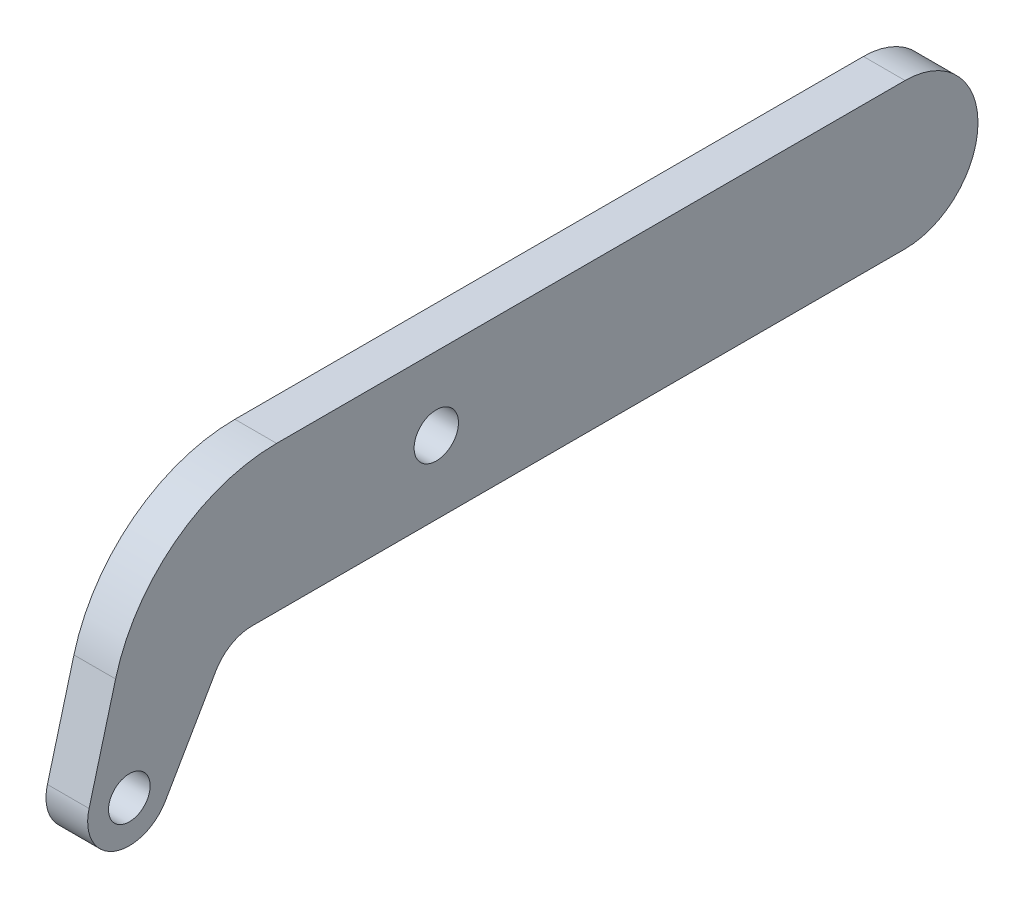
ISO-10303-21;
HEADER;
FILE_DESCRIPTION(('STEP AP214'),'2;1');
FILE_NAME('part.step','',(''),(''),'','','');
FILE_SCHEMA(('AUTOMOTIVE_DESIGN { 1 0 10303 214 1 1 1 1 }'));
ENDSEC;
DATA;
#1=APPLICATION_CONTEXT('core data for automotive mechanical design processes');
#2=APPLICATION_PROTOCOL_DEFINITION('international standard','automotive_design',2000,#1);
#3=PRODUCT_CONTEXT('',#1,'mechanical');
#4=PRODUCT('Part','Part','',(#3));
#5=PRODUCT_RELATED_PRODUCT_CATEGORY('part','',(#4));
#6=PRODUCT_DEFINITION_FORMATION('','',#4);
#7=PRODUCT_DEFINITION_CONTEXT('part definition',#1,'design');
#8=PRODUCT_DEFINITION('design','',#6,#7);
#9=PRODUCT_DEFINITION_SHAPE('','',#8);
#10=(LENGTH_UNIT() NAMED_UNIT(*) SI_UNIT(.MILLI.,.METRE.));
#11=(NAMED_UNIT(*) PLANE_ANGLE_UNIT() SI_UNIT($,.RADIAN.));
#12=(NAMED_UNIT(*) SI_UNIT($,.STERADIAN.) SOLID_ANGLE_UNIT());
#13=UNCERTAINTY_MEASURE_WITH_UNIT(LENGTH_MEASURE(1.E-05),#10,'distance_accuracy_value','');
#14=(GEOMETRIC_REPRESENTATION_CONTEXT(3) GLOBAL_UNCERTAINTY_ASSIGNED_CONTEXT((#13)) GLOBAL_UNIT_ASSIGNED_CONTEXT((#10,
#11,#12)) REPRESENTATION_CONTEXT('',''));
#15=CARTESIAN_POINT('',(0.,0.,0.));
#16=DIRECTION('',(0.,0.,1.));
#17=DIRECTION('',(1.,0.,0.));
#18=AXIS2_PLACEMENT_3D('',#15,#16,#17);
#19=CARTESIAN_POINT('',(6.35,11.1125,-103.1875));
#20=DIRECTION('',(1.,0.,0.));
#21=DIRECTION('',(0.,0.,-1.));
#22=AXIS2_PLACEMENT_3D('',#19,#20,#21);
#23=PLANE('',#22);
#24=CARTESIAN_POINT('',(6.35,-13.3227839420935,15.0242613140312));
#25=DIRECTION('',(1.,0.,0.));
#26=DIRECTION('',(0.,0.,-1.));
#27=AXIS2_PLACEMENT_3D('',#24,#25,#26);
#28=CIRCLE('',#27,3.175);
#29=CARTESIAN_POINT('',(6.35,-13.3227839420935,11.8492613140312));
#30=VERTEX_POINT('',#29);
#31=EDGE_CURVE('E133',#30,#30,#28,.T.);
#32=ORIENTED_EDGE('',*,*,#31,.F.);
#33=EDGE_LOOP('',(#32));
#34=FACE_BOUND('',#33,.T.);
#35=CARTESIAN_POINT('',(6.35,11.1125,-103.1875));
#36=DIRECTION('',(1.,0.,0.));
#37=DIRECTION('',(0.,0.,-1.));
#38=AXIS2_PLACEMENT_3D('',#35,#36,#37);
#39=CIRCLE('',#38,11.1125);
#40=CARTESIAN_POINT('',(6.35,0.,-103.1875));
#41=VERTEX_POINT('',#40);
#42=CARTESIAN_POINT('',(6.35,22.225,-103.1875));
#43=VERTEX_POINT('',#42);
#44=EDGE_CURVE('E144',#41,#43,#39,.T.);
#45=ORIENTED_EDGE('',*,*,#44,.T.);
#46=DIRECTION('',(0.,0.,1.));
#47=VECTOR('',#46,1.);
#48=CARTESIAN_POINT('',(6.35,22.225,-103.1875));
#49=LINE('',#48,#47);
#50=CARTESIAN_POINT('',(6.35,22.225,-7.41684043503048));
#51=VERTEX_POINT('',#50);
#52=EDGE_CURVE('E92',#43,#51,#49,.T.);
#53=ORIENTED_EDGE('',*,*,#52,.T.);
#54=CARTESIAN_POINT('',(6.35,-3.17499999999999,-7.41684043503048));
#55=DIRECTION('',(1.,0.,0.));
#56=DIRECTION('',(0.,0.,-1.));
#57=AXIS2_PLACEMENT_3D('',#54,#55,#56);
#58=CIRCLE('',#57,25.4);
#59=CARTESIAN_POINT('',(6.35,3.3990037456043,17.1176755527118));
#60=VERTEX_POINT('',#59);
#61=EDGE_CURVE('E159',#51,#60,#58,.T.);
#62=ORIENTED_EDGE('',*,*,#61,.T.);
#63=DIRECTION('',(0.,-0.965925826289065,0.258819045102531));
#64=VECTOR('',#63,1.);
#65=CARTESIAN_POINT('',(6.35,-11.6792830056924,21.1578903109668));
#66=LINE('',#65,#64);
#67=CARTESIAN_POINT('',(6.35,-11.6792830056924,21.1578903109668));
#68=VERTEX_POINT('',#67);
#69=EDGE_CURVE('E172',#60,#68,#66,.T.);
#70=ORIENTED_EDGE('',*,*,#69,.T.);
#71=CARTESIAN_POINT('',(6.35,-13.3227839420935,15.0242613140312));
#72=DIRECTION('',(1.,0.,0.));
#73=DIRECTION('',(0.,0.,1.));
#74=AXIS2_PLACEMENT_3D('',#71,#72,#73);
#75=CIRCLE('',#74,6.35);
#76=CARTESIAN_POINT('',(6.35,-16.4977839420935,9.52500000000007));
#77=VERTEX_POINT('',#76);
#78=EDGE_CURVE('E111',#68,#77,#75,.T.);
#79=ORIENTED_EDGE('',*,*,#78,.T.);
#80=DIRECTION('',(0.,0.866025403784436,-0.500000000000004));
#81=VECTOR('',#80,1.);
#82=CARTESIAN_POINT('',(6.35,-3.17499999999998,1.83308710467707));
#83=LINE('',#82,#81);
#84=CARTESIAN_POINT('',(6.35,-3.17499999999998,1.83308710467707));
#85=VERTEX_POINT('',#84);
#86=EDGE_CURVE('E105',#77,#85,#83,.T.);
#87=ORIENTED_EDGE('',*,*,#86,.T.);
#88=CARTESIAN_POINT('',(6.35,-6.35,-3.66617420935411));
#89=DIRECTION('',(-1.,0.,0.));
#90=DIRECTION('',(0.,0.,1.));
#91=AXIS2_PLACEMENT_3D('',#88,#89,#90);
#92=CIRCLE('',#91,6.35);
#93=CARTESIAN_POINT('',(6.35,0.,-3.6661742093541));
#94=VERTEX_POINT('',#93);
#95=EDGE_CURVE('E109',#85,#94,#92,.T.);
#96=ORIENTED_EDGE('',*,*,#95,.T.);
#97=DIRECTION('',(0.,0.,-1.));
#98=VECTOR('',#97,1.);
#99=CARTESIAN_POINT('',(6.35,0.,-3.6661742093541));
#100=LINE('',#99,#98);
#101=EDGE_CURVE('E49',#94,#41,#100,.T.);
#102=ORIENTED_EDGE('',*,*,#101,.T.);
#103=EDGE_LOOP('',(#45,#53,#62,#70,#79,#87,#96,#102));
#104=FACE_BOUND('',#103,.T.);
#105=CARTESIAN_POINT('',(6.35,11.1125,-31.75));
#106=DIRECTION('',(1.,0.,0.));
#107=DIRECTION('',(0.,0.,-1.));
#108=AXIS2_PLACEMENT_3D('',#105,#106,#107);
#109=CIRCLE('',#108,3.3782);
#110=CARTESIAN_POINT('',(6.35,11.1125,-35.1282));
#111=VERTEX_POINT('',#110);
#112=EDGE_CURVE('E181',#111,#111,#109,.T.);
#113=ORIENTED_EDGE('',*,*,#112,.F.);
#114=EDGE_LOOP('',(#113));
#115=FACE_BOUND('',#114,.T.);
#116=ADVANCED_FACE('F32',(#34,#104,#115),#23,.T.);
#117=CARTESIAN_POINT('',(0.,11.1125,-103.1875));
#118=DIRECTION('',(1.,0.,0.));
#119=DIRECTION('',(0.,0.,-1.));
#120=AXIS2_PLACEMENT_3D('',#117,#118,#119);
#121=PLANE('',#120);
#122=CARTESIAN_POINT('',(0.,11.1125,-103.1875));
#123=DIRECTION('',(1.,0.,0.));
#124=DIRECTION('',(0.,0.,-1.));
#125=AXIS2_PLACEMENT_3D('',#122,#123,#124);
#126=CIRCLE('',#125,11.1125);
#127=CARTESIAN_POINT('',(0.,0.,-103.1875));
#128=VERTEX_POINT('',#127);
#129=CARTESIAN_POINT('',(0.,22.225,-103.1875));
#130=VERTEX_POINT('',#129);
#131=EDGE_CURVE('E129',#128,#130,#126,.T.);
#132=ORIENTED_EDGE('',*,*,#131,.F.);
#133=DIRECTION('',(0.,0.,-1.));
#134=VECTOR('',#133,1.);
#135=CARTESIAN_POINT('',(0.,0.,-3.6661742093541));
#136=LINE('',#135,#134);
#137=CARTESIAN_POINT('',(0.,0.,-3.6661742093541));
#138=VERTEX_POINT('',#137);
#139=EDGE_CURVE('E84',#138,#128,#136,.T.);
#140=ORIENTED_EDGE('',*,*,#139,.F.);
#141=CARTESIAN_POINT('',(0.,-6.35,-3.66617420935411));
#142=DIRECTION('',(-1.,0.,0.));
#143=DIRECTION('',(0.,0.,1.));
#144=AXIS2_PLACEMENT_3D('',#141,#142,#143);
#145=CIRCLE('',#144,6.35);
#146=CARTESIAN_POINT('',(0.,-3.17499999999998,1.83308710467707));
#147=VERTEX_POINT('',#146);
#148=EDGE_CURVE('E78',#147,#138,#145,.T.);
#149=ORIENTED_EDGE('',*,*,#148,.F.);
#150=DIRECTION('',(0.,0.866025403784436,-0.500000000000004));
#151=VECTOR('',#150,1.);
#152=CARTESIAN_POINT('',(0.,-3.17499999999998,1.83308710467707));
#153=LINE('',#152,#151);
#154=CARTESIAN_POINT('',(0.,-16.4977839420935,9.52500000000007));
#155=VERTEX_POINT('',#154);
#156=EDGE_CURVE('E119',#155,#147,#153,.T.);
#157=ORIENTED_EDGE('',*,*,#156,.F.);
#158=CARTESIAN_POINT('',(0.,-13.3227839420935,15.0242613140312));
#159=DIRECTION('',(1.,0.,0.));
#160=DIRECTION('',(0.,0.,1.));
#161=AXIS2_PLACEMENT_3D('',#158,#159,#160);
#162=CIRCLE('',#161,6.35);
#163=CARTESIAN_POINT('',(0.,-11.6792830056924,21.1578903109668));
#164=VERTEX_POINT('',#163);
#165=EDGE_CURVE('E139',#164,#155,#162,.T.);
#166=ORIENTED_EDGE('',*,*,#165,.F.);
#167=DIRECTION('',(0.,-0.965925826289065,0.258819045102531));
#168=VECTOR('',#167,1.);
#169=CARTESIAN_POINT('',(0.,-11.6792830056924,21.1578903109668));
#170=LINE('',#169,#168);
#171=CARTESIAN_POINT('',(0.,3.3990037456043,17.1176755527118));
#172=VERTEX_POINT('',#171);
#173=EDGE_CURVE('E137',#172,#164,#170,.T.);
#174=ORIENTED_EDGE('',*,*,#173,.F.);
#175=CARTESIAN_POINT('',(0.,-3.17499999999999,-7.41684043503048));
#176=DIRECTION('',(1.,0.,0.));
#177=DIRECTION('',(0.,0.,-1.));
#178=AXIS2_PLACEMENT_3D('',#175,#176,#177);
#179=CIRCLE('',#178,25.4);
#180=CARTESIAN_POINT('',(0.,22.225,-7.41684043503048));
#181=VERTEX_POINT('',#180);
#182=EDGE_CURVE('E135',#181,#172,#179,.T.);
#183=ORIENTED_EDGE('',*,*,#182,.F.);
#184=DIRECTION('',(0.,0.,1.));
#185=VECTOR('',#184,1.);
#186=CARTESIAN_POINT('',(0.,22.225,-103.1875));
#187=LINE('',#186,#185);
#188=EDGE_CURVE('E132',#130,#181,#187,.T.);
#189=ORIENTED_EDGE('',*,*,#188,.F.);
#190=EDGE_LOOP('',(#132,#140,#149,#157,#166,#174,#183,#189));
#191=FACE_BOUND('',#190,.T.);
#192=CARTESIAN_POINT('',(0.,-13.3227839420935,15.0242613140312));
#193=DIRECTION('',(1.,0.,0.));
#194=DIRECTION('',(0.,0.,-1.));
#195=AXIS2_PLACEMENT_3D('',#192,#193,#194);
#196=CIRCLE('',#195,3.175);
#197=CARTESIAN_POINT('',(0.,-13.3227839420935,11.8492613140312));
#198=VERTEX_POINT('',#197);
#199=EDGE_CURVE('E178',#198,#198,#196,.T.);
#200=ORIENTED_EDGE('',*,*,#199,.T.);
#201=EDGE_LOOP('',(#200));
#202=FACE_BOUND('',#201,.T.);
#203=CARTESIAN_POINT('',(0.,11.1125,-31.75));
#204=DIRECTION('',(1.,0.,0.));
#205=DIRECTION('',(0.,0.,-1.));
#206=AXIS2_PLACEMENT_3D('',#203,#204,#205);
#207=CIRCLE('',#206,3.3782);
#208=CARTESIAN_POINT('',(0.,11.1125,-35.1282));
#209=VERTEX_POINT('',#208);
#210=EDGE_CURVE('E184',#209,#209,#207,.T.);
#211=ORIENTED_EDGE('',*,*,#210,.T.);
#212=EDGE_LOOP('',(#211));
#213=FACE_BOUND('',#212,.T.);
#214=ADVANCED_FACE('F163',(#191,#202,#213),#121,.F.);
#215=CARTESIAN_POINT('',(6.35,11.1125,-103.1875));
#216=DIRECTION('',(-1.,0.,0.));
#217=DIRECTION('',(0.,0.,1.));
#218=AXIS2_PLACEMENT_3D('',#215,#216,#217);
#219=CYLINDRICAL_SURFACE('',#218,11.1125);
#220=ORIENTED_EDGE('',*,*,#131,.T.);
#221=DIRECTION('',(-1.,0.,0.));
#222=VECTOR('',#221,1.);
#223=CARTESIAN_POINT('',(6.35,22.225,-103.1875));
#224=LINE('',#223,#222);
#225=EDGE_CURVE('E11',#43,#130,#224,.T.);
#226=ORIENTED_EDGE('',*,*,#225,.F.);
#227=ORIENTED_EDGE('',*,*,#44,.F.);
#228=DIRECTION('',(-1.,0.,0.));
#229=VECTOR('',#228,1.);
#230=CARTESIAN_POINT('',(6.35,0.,-103.1875));
#231=LINE('',#230,#229);
#232=EDGE_CURVE('E125',#41,#128,#231,.T.);
#233=ORIENTED_EDGE('',*,*,#232,.T.);
#234=EDGE_LOOP('',(#220,#226,#227,#233));
#235=FACE_BOUND('',#234,.T.);
#236=ADVANCED_FACE('F34',(#235),#219,.T.);
#237=CARTESIAN_POINT('',(6.35,22.225,-103.1875));
#238=DIRECTION('',(0.,-1.,0.));
#239=DIRECTION('',(0.,0.,-1.));
#240=AXIS2_PLACEMENT_3D('',#237,#238,#239);
#241=PLANE('',#240);
#242=ORIENTED_EDGE('',*,*,#188,.T.);
#243=DIRECTION('',(-1.,0.,0.));
#244=VECTOR('',#243,1.);
#245=CARTESIAN_POINT('',(6.35,22.225,-7.41684043503048));
#246=LINE('',#245,#244);
#247=EDGE_CURVE('E41',#51,#181,#246,.T.);
#248=ORIENTED_EDGE('',*,*,#247,.F.);
#249=ORIENTED_EDGE('',*,*,#52,.F.);
#250=ORIENTED_EDGE('',*,*,#225,.T.);
#251=EDGE_LOOP('',(#242,#248,#249,#250));
#252=FACE_BOUND('',#251,.T.);
#253=ADVANCED_FACE('F216',(#252),#241,.F.);
#254=CARTESIAN_POINT('',(6.35,-3.17499999999999,-7.41684043503048));
#255=DIRECTION('',(-1.,0.,0.));
#256=DIRECTION('',(0.,0.,1.));
#257=AXIS2_PLACEMENT_3D('',#254,#255,#256);
#258=CYLINDRICAL_SURFACE('',#257,25.4);
#259=ORIENTED_EDGE('',*,*,#182,.T.);
#260=DIRECTION('',(-1.,0.,0.));
#261=VECTOR('',#260,1.);
#262=CARTESIAN_POINT('',(6.35,3.3990037456043,17.1176755527118));
#263=LINE('',#262,#261);
#264=EDGE_CURVE('E151',#60,#172,#263,.T.);
#265=ORIENTED_EDGE('',*,*,#264,.F.);
#266=ORIENTED_EDGE('',*,*,#61,.F.);
#267=ORIENTED_EDGE('',*,*,#247,.T.);
#268=EDGE_LOOP('',(#259,#265,#266,#267));
#269=FACE_BOUND('',#268,.T.);
#270=ADVANCED_FACE('F157',(#269),#258,.T.);
#271=CARTESIAN_POINT('',(6.35,-11.6792830056924,21.1578903109668));
#272=DIRECTION('',(0.,-0.258819045102531,-0.965925826289065));
#273=DIRECTION('',(0.,0.965925826289066,-0.258819045102531));
#274=AXIS2_PLACEMENT_3D('',#271,#272,#273);
#275=PLANE('',#274);
#276=ORIENTED_EDGE('',*,*,#173,.T.);
#277=DIRECTION('',(-1.,0.,0.));
#278=VECTOR('',#277,1.);
#279=CARTESIAN_POINT('',(6.35,-11.6792830056924,21.1578903109668));
#280=LINE('',#279,#278);
#281=EDGE_CURVE('E148',#68,#164,#280,.T.);
#282=ORIENTED_EDGE('',*,*,#281,.F.);
#283=ORIENTED_EDGE('',*,*,#69,.F.);
#284=ORIENTED_EDGE('',*,*,#264,.T.);
#285=EDGE_LOOP('',(#276,#282,#283,#284));
#286=FACE_BOUND('',#285,.T.);
#287=ADVANCED_FACE('F168',(#286),#275,.F.);
#288=CARTESIAN_POINT('',(6.35,-13.3227839420935,15.0242613140312));
#289=DIRECTION('',(-1.,0.,0.));
#290=DIRECTION('',(0.,0.,1.));
#291=AXIS2_PLACEMENT_3D('',#288,#289,#290);
#292=CYLINDRICAL_SURFACE('',#291,6.35);
#293=ORIENTED_EDGE('',*,*,#165,.T.);
#294=DIRECTION('',(-1.,0.,0.));
#295=VECTOR('',#294,1.);
#296=CARTESIAN_POINT('',(6.35,-16.4977839420935,9.52500000000007));
#297=LINE('',#296,#295);
#298=EDGE_CURVE('E120',#77,#155,#297,.T.);
#299=ORIENTED_EDGE('',*,*,#298,.F.);
#300=ORIENTED_EDGE('',*,*,#78,.F.);
#301=ORIENTED_EDGE('',*,*,#281,.T.);
#302=EDGE_LOOP('',(#293,#299,#300,#301));
#303=FACE_BOUND('',#302,.T.);
#304=ADVANCED_FACE('F171',(#303),#292,.T.);
#305=CARTESIAN_POINT('',(6.35,-3.17499999999998,1.83308710467707));
#306=DIRECTION('',(0.,0.500000000000004,0.866025403784436));
#307=DIRECTION('',(0.,-0.866025403784436,0.500000000000004));
#308=AXIS2_PLACEMENT_3D('',#305,#306,#307);
#309=PLANE('',#308);
#310=ORIENTED_EDGE('',*,*,#156,.T.);
#311=DIRECTION('',(-1.,0.,0.));
#312=VECTOR('',#311,1.);
#313=CARTESIAN_POINT('',(6.35,-3.17499999999998,1.83308710467707));
#314=LINE('',#313,#312);
#315=EDGE_CURVE('E116',#85,#147,#314,.T.);
#316=ORIENTED_EDGE('',*,*,#315,.F.);
#317=ORIENTED_EDGE('',*,*,#86,.F.);
#318=ORIENTED_EDGE('',*,*,#298,.T.);
#319=EDGE_LOOP('',(#310,#316,#317,#318));
#320=FACE_BOUND('',#319,.T.);
#321=ADVANCED_FACE('F117',(#320),#309,.F.);
#322=CARTESIAN_POINT('',(6.35,-6.35,-3.66617420935411));
#323=DIRECTION('',(-1.,0.,0.));
#324=DIRECTION('',(0.,0.,1.));
#325=AXIS2_PLACEMENT_3D('',#322,#323,#324);
#326=CYLINDRICAL_SURFACE('',#325,6.35);
#327=ORIENTED_EDGE('',*,*,#148,.T.);
#328=DIRECTION('',(-1.,0.,0.));
#329=VECTOR('',#328,1.);
#330=CARTESIAN_POINT('',(6.35,0.,-3.6661742093541));
#331=LINE('',#330,#329);
#332=EDGE_CURVE('E121',#94,#138,#331,.T.);
#333=ORIENTED_EDGE('',*,*,#332,.F.);
#334=ORIENTED_EDGE('',*,*,#95,.F.);
#335=ORIENTED_EDGE('',*,*,#315,.T.);
#336=EDGE_LOOP('',(#327,#333,#334,#335));
#337=FACE_BOUND('',#336,.T.);
#338=ADVANCED_FACE('F123',(#337),#326,.F.);
#339=CARTESIAN_POINT('',(6.35,0.,-3.6661742093541));
#340=DIRECTION('',(0.,1.,0.));
#341=DIRECTION('',(0.,0.,1.));
#342=AXIS2_PLACEMENT_3D('',#339,#340,#341);
#343=PLANE('',#342);
#344=ORIENTED_EDGE('',*,*,#139,.T.);
#345=ORIENTED_EDGE('',*,*,#232,.F.);
#346=ORIENTED_EDGE('',*,*,#101,.F.);
#347=ORIENTED_EDGE('',*,*,#332,.T.);
#348=EDGE_LOOP('',(#344,#345,#346,#347));
#349=FACE_BOUND('',#348,.T.);
#350=ADVANCED_FACE('F204',(#349),#343,.F.);
#351=CARTESIAN_POINT('',(6.35,-13.3227839420935,15.0242613140312));
#352=DIRECTION('',(-1.,0.,0.));
#353=DIRECTION('',(0.,0.,1.));
#354=AXIS2_PLACEMENT_3D('',#351,#352,#353);
#355=CYLINDRICAL_SURFACE('',#354,3.175);
#356=ORIENTED_EDGE('',*,*,#31,.T.);
#357=EDGE_LOOP('',(#356));
#358=FACE_BOUND('',#357,.T.);
#359=ORIENTED_EDGE('',*,*,#199,.F.);
#360=EDGE_LOOP('',(#359));
#361=FACE_BOUND('',#360,.T.);
#362=ADVANCED_FACE('F201',(#358,#361),#355,.F.);
#363=CARTESIAN_POINT('',(6.35,11.1125,-31.75));
#364=DIRECTION('',(-1.,0.,0.));
#365=DIRECTION('',(0.,0.,1.));
#366=AXIS2_PLACEMENT_3D('',#363,#364,#365);
#367=CYLINDRICAL_SURFACE('',#366,3.3782);
#368=ORIENTED_EDGE('',*,*,#112,.T.);
#369=EDGE_LOOP('',(#368));
#370=FACE_BOUND('',#369,.T.);
#371=ORIENTED_EDGE('',*,*,#210,.F.);
#372=EDGE_LOOP('',(#371));
#373=FACE_BOUND('',#372,.T.);
#374=ADVANCED_FACE('F190',(#370,#373),#367,.F.);
#375=CLOSED_SHELL('',(#116,#214,#236,#253,#270,#287,#304,#321,#338,#350,#362,#374));
#376=MANIFOLD_SOLID_BREP('B2',#375);
#377=ADVANCED_BREP_SHAPE_REPRESENTATION('',(#18,#376),#14);
#378=SHAPE_DEFINITION_REPRESENTATION(#9,#377);
ENDSEC;
END-ISO-10303-21;
